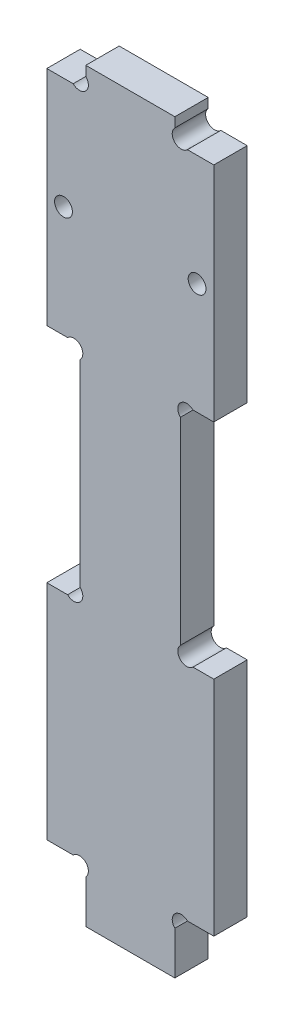
ISO-10303-21;
HEADER;
FILE_DESCRIPTION(('STEP AP214'),'2;1');
FILE_NAME('part.step','',(''),(''),'','','');
FILE_SCHEMA(('AUTOMOTIVE_DESIGN { 1 0 10303 214 1 1 1 1 }'));
ENDSEC;
DATA;
#1=APPLICATION_CONTEXT('core data for automotive mechanical design processes');
#2=APPLICATION_PROTOCOL_DEFINITION('international standard','automotive_design',2000,#1);
#3=PRODUCT_CONTEXT('',#1,'mechanical');
#4=PRODUCT('Part','Part','',(#3));
#5=PRODUCT_RELATED_PRODUCT_CATEGORY('part','',(#4));
#6=PRODUCT_DEFINITION_FORMATION('','',#4);
#7=PRODUCT_DEFINITION_CONTEXT('part definition',#1,'design');
#8=PRODUCT_DEFINITION('design','',#6,#7);
#9=PRODUCT_DEFINITION_SHAPE('','',#8);
#10=(LENGTH_UNIT() NAMED_UNIT(*) SI_UNIT(.MILLI.,.METRE.));
#11=(NAMED_UNIT(*) PLANE_ANGLE_UNIT() SI_UNIT($,.RADIAN.));
#12=(NAMED_UNIT(*) SI_UNIT($,.STERADIAN.) SOLID_ANGLE_UNIT());
#13=UNCERTAINTY_MEASURE_WITH_UNIT(LENGTH_MEASURE(1.E-05),#10,'distance_accuracy_value','');
#14=(GEOMETRIC_REPRESENTATION_CONTEXT(3) GLOBAL_UNCERTAINTY_ASSIGNED_CONTEXT((#13)) GLOBAL_UNIT_ASSIGNED_CONTEXT((#10,
#11,#12)) REPRESENTATION_CONTEXT('',''));
#15=CARTESIAN_POINT('',(0.,0.,0.));
#16=DIRECTION('',(0.,0.,1.));
#17=DIRECTION('',(1.,0.,0.));
#18=AXIS2_PLACEMENT_3D('',#15,#16,#17);
#19=CARTESIAN_POINT('',(24.1313708498985,8.86862915010153,6.));
#20=DIRECTION('',(0.,0.,1.));
#21=DIRECTION('',(1.,0.,0.));
#22=AXIS2_PLACEMENT_3D('',#19,#20,#21);
#23=PLANE('',#22);
#24=CARTESIAN_POINT('',(27.,110.,6.));
#25=DIRECTION('',(0.,0.,1.));
#26=DIRECTION('',(-1.,0.,0.));
#27=AXIS2_PLACEMENT_3D('',#24,#25,#26);
#28=CIRCLE('',#27,1.6);
#29=CARTESIAN_POINT('',(25.4,110.,6.));
#30=VERTEX_POINT('',#29);
#31=EDGE_CURVE('E241',#30,#30,#28,.T.);
#32=ORIENTED_EDGE('',*,*,#31,.F.);
#33=EDGE_LOOP('',(#32));
#34=FACE_BOUND('',#33,.T.);
#35=DIRECTION('',(0.,1.,0.));
#36=VECTOR('',#35,1.);
#37=CARTESIAN_POINT('',(30.,50.,6.));
#38=LINE('',#37,#36);
#39=CARTESIAN_POINT('',(30.,10.,6.));
#40=VERTEX_POINT('',#39);
#41=CARTESIAN_POINT('',(30.,50.,6.));
#42=VERTEX_POINT('',#41);
#43=EDGE_CURVE('E299',#40,#42,#38,.T.);
#44=ORIENTED_EDGE('',*,*,#43,.T.);
#45=DIRECTION('',(-1.,0.,0.));
#46=VECTOR('',#45,1.);
#47=CARTESIAN_POINT('',(26.262741699797,50.,6.));
#48=LINE('',#47,#46);
#49=CARTESIAN_POINT('',(26.262741699797,50.,6.));
#50=VERTEX_POINT('',#49);
#51=EDGE_CURVE('E236',#42,#50,#48,.T.);
#52=ORIENTED_EDGE('',*,*,#51,.T.);
#53=CARTESIAN_POINT('',(25.1313708498985,51.1313708498985,6.));
#54=DIRECTION('',(0.,0.,-1.));
#55=DIRECTION('',(1.,0.,0.));
#56=AXIS2_PLACEMENT_3D('',#53,#54,#55);
#57=CIRCLE('',#56,1.6);
#58=CARTESIAN_POINT('',(24.,52.2627416997969,6.));
#59=VERTEX_POINT('',#58);
#60=EDGE_CURVE('E302',#50,#59,#57,.T.);
#61=ORIENTED_EDGE('',*,*,#60,.T.);
#62=DIRECTION('',(0.,1.,0.));
#63=VECTOR('',#62,1.);
#64=CARTESIAN_POINT('',(24.,87.7372583002031,6.));
#65=LINE('',#64,#63);
#66=CARTESIAN_POINT('',(24.,87.7372583002031,6.));
#67=VERTEX_POINT('',#66);
#68=EDGE_CURVE('E304',#59,#67,#65,.T.);
#69=ORIENTED_EDGE('',*,*,#68,.T.);
#70=CARTESIAN_POINT('',(25.1313708498985,88.8686291501015,6.));
#71=DIRECTION('',(0.,0.,-1.));
#72=DIRECTION('',(-1.,0.,0.));
#73=AXIS2_PLACEMENT_3D('',#70,#71,#72);
#74=CIRCLE('',#73,1.6);
#75=CARTESIAN_POINT('',(26.262741699797,90.,6.));
#76=VERTEX_POINT('',#75);
#77=EDGE_CURVE('E306',#67,#76,#74,.T.);
#78=ORIENTED_EDGE('',*,*,#77,.T.);
#79=DIRECTION('',(1.,0.,0.));
#80=VECTOR('',#79,1.);
#81=CARTESIAN_POINT('',(26.262741699797,90.,6.));
#82=LINE('',#81,#80);
#83=CARTESIAN_POINT('',(30.,90.,6.));
#84=VERTEX_POINT('',#83);
#85=EDGE_CURVE('E308',#76,#84,#82,.T.);
#86=ORIENTED_EDGE('',*,*,#85,.T.);
#87=DIRECTION('',(0.,1.,0.));
#88=VECTOR('',#87,1.);
#89=CARTESIAN_POINT('',(30.,90.,6.));
#90=LINE('',#89,#88);
#91=CARTESIAN_POINT('',(30.,130.,6.));
#92=VERTEX_POINT('',#91);
#93=EDGE_CURVE('E310',#84,#92,#90,.T.);
#94=ORIENTED_EDGE('',*,*,#93,.T.);
#95=DIRECTION('',(-1.,0.,0.));
#96=VECTOR('',#95,1.);
#97=CARTESIAN_POINT('',(25.262741699797,130.,6.));
#98=LINE('',#97,#96);
#99=CARTESIAN_POINT('',(25.262741699797,130.,6.));
#100=VERTEX_POINT('',#99);
#101=EDGE_CURVE('E312',#92,#100,#98,.T.);
#102=ORIENTED_EDGE('',*,*,#101,.T.);
#103=CARTESIAN_POINT('',(24.1313708498985,131.131370849898,6.));
#104=DIRECTION('',(0.,0.,-1.));
#105=DIRECTION('',(-1.,0.,0.));
#106=AXIS2_PLACEMENT_3D('',#103,#104,#105);
#107=CIRCLE('',#106,1.60000000000001);
#108=CARTESIAN_POINT('',(23.,132.262741699797,6.));
#109=VERTEX_POINT('',#108);
#110=EDGE_CURVE('E314',#100,#109,#107,.T.);
#111=ORIENTED_EDGE('',*,*,#110,.T.);
#112=DIRECTION('',(0.,1.,0.));
#113=VECTOR('',#112,1.);
#114=CARTESIAN_POINT('',(23.,132.262741699797,6.));
#115=LINE('',#114,#113);
#116=CARTESIAN_POINT('',(23.,134.,6.));
#117=VERTEX_POINT('',#116);
#118=EDGE_CURVE('E316',#109,#117,#115,.T.);
#119=ORIENTED_EDGE('',*,*,#118,.T.);
#120=DIRECTION('',(-1.,0.,0.));
#121=VECTOR('',#120,1.);
#122=CARTESIAN_POINT('',(6.99999999999998,134.,6.));
#123=LINE('',#122,#121);
#124=CARTESIAN_POINT('',(6.99999999999998,134.,6.));
#125=VERTEX_POINT('',#124);
#126=EDGE_CURVE('E318',#117,#125,#123,.T.);
#127=ORIENTED_EDGE('',*,*,#126,.T.);
#128=DIRECTION('',(0.,-1.,0.));
#129=VECTOR('',#128,1.);
#130=CARTESIAN_POINT('',(6.99999999999998,132.262741699797,6.));
#131=LINE('',#130,#129);
#132=CARTESIAN_POINT('',(6.99999999999998,132.262741699797,6.));
#133=VERTEX_POINT('',#132);
#134=EDGE_CURVE('E320',#125,#133,#131,.T.);
#135=ORIENTED_EDGE('',*,*,#134,.T.);
#136=CARTESIAN_POINT('',(5.8686291501015,131.131370849898,6.));
#137=DIRECTION('',(0.,0.,-1.));
#138=DIRECTION('',(1.,0.,0.));
#139=AXIS2_PLACEMENT_3D('',#136,#137,#138);
#140=CIRCLE('',#139,1.60000000000001);
#141=CARTESIAN_POINT('',(4.73725830020302,130.,6.));
#142=VERTEX_POINT('',#141);
#143=EDGE_CURVE('E322',#133,#142,#140,.T.);
#144=ORIENTED_EDGE('',*,*,#143,.T.);
#145=DIRECTION('',(-1.,0.,0.));
#146=VECTOR('',#145,1.);
#147=CARTESIAN_POINT('',(4.73725830020302,130.,6.));
#148=LINE('',#147,#146);
#149=CARTESIAN_POINT('',(0.,130.,6.));
#150=VERTEX_POINT('',#149);
#151=EDGE_CURVE('E324',#142,#150,#148,.T.);
#152=ORIENTED_EDGE('',*,*,#151,.T.);
#153=DIRECTION('',(0.,-1.,0.));
#154=VECTOR('',#153,1.);
#155=CARTESIAN_POINT('',(0.,90.,6.));
#156=LINE('',#155,#154);
#157=CARTESIAN_POINT('',(0.,90.,6.));
#158=VERTEX_POINT('',#157);
#159=EDGE_CURVE('E326',#150,#158,#156,.T.);
#160=ORIENTED_EDGE('',*,*,#159,.T.);
#161=DIRECTION('',(1.,0.,0.));
#162=VECTOR('',#161,1.);
#163=CARTESIAN_POINT('',(3.73725830020305,90.,6.));
#164=LINE('',#163,#162);
#165=CARTESIAN_POINT('',(3.73725830020305,90.,6.));
#166=VERTEX_POINT('',#165);
#167=EDGE_CURVE('E328',#158,#166,#164,.T.);
#168=ORIENTED_EDGE('',*,*,#167,.T.);
#169=CARTESIAN_POINT('',(4.86862915010152,88.8686291501015,6.));
#170=DIRECTION('',(0.,0.,-1.));
#171=DIRECTION('',(1.,0.,0.));
#172=AXIS2_PLACEMENT_3D('',#169,#170,#171);
#173=CIRCLE('',#172,1.6);
#174=CARTESIAN_POINT('',(6.,87.7372583002031,6.));
#175=VERTEX_POINT('',#174);
#176=EDGE_CURVE('E330',#166,#175,#173,.T.);
#177=ORIENTED_EDGE('',*,*,#176,.T.);
#178=DIRECTION('',(0.,-1.,0.));
#179=VECTOR('',#178,1.);
#180=CARTESIAN_POINT('',(6.,87.7372583002031,6.));
#181=LINE('',#180,#179);
#182=CARTESIAN_POINT('',(6.,52.2627416997969,6.));
#183=VERTEX_POINT('',#182);
#184=EDGE_CURVE('E332',#175,#183,#181,.T.);
#185=ORIENTED_EDGE('',*,*,#184,.T.);
#186=CARTESIAN_POINT('',(4.86862915010152,51.1313708498985,6.));
#187=DIRECTION('',(0.,0.,-1.));
#188=DIRECTION('',(-1.,0.,0.));
#189=AXIS2_PLACEMENT_3D('',#186,#187,#188);
#190=CIRCLE('',#189,1.6);
#191=CARTESIAN_POINT('',(3.73725830020305,50.,6.));
#192=VERTEX_POINT('',#191);
#193=EDGE_CURVE('E334',#183,#192,#190,.T.);
#194=ORIENTED_EDGE('',*,*,#193,.T.);
#195=DIRECTION('',(-1.,0.,0.));
#196=VECTOR('',#195,1.);
#197=CARTESIAN_POINT('',(3.73725830020305,50.,6.));
#198=LINE('',#197,#196);
#199=CARTESIAN_POINT('',(0.,50.,6.));
#200=VERTEX_POINT('',#199);
#201=EDGE_CURVE('E336',#192,#200,#198,.T.);
#202=ORIENTED_EDGE('',*,*,#201,.T.);
#203=DIRECTION('',(0.,-1.,0.));
#204=VECTOR('',#203,1.);
#205=CARTESIAN_POINT('',(0.,50.,6.));
#206=LINE('',#205,#204);
#207=CARTESIAN_POINT('',(0.,10.,6.));
#208=VERTEX_POINT('',#207);
#209=EDGE_CURVE('E338',#200,#208,#206,.T.);
#210=ORIENTED_EDGE('',*,*,#209,.T.);
#211=DIRECTION('',(1.,0.,0.));
#212=VECTOR('',#211,1.);
#213=CARTESIAN_POINT('',(4.73725830020302,10.,6.));
#214=LINE('',#213,#212);
#215=CARTESIAN_POINT('',(4.73725830020302,10.,6.));
#216=VERTEX_POINT('',#215);
#217=EDGE_CURVE('E340',#208,#216,#214,.T.);
#218=ORIENTED_EDGE('',*,*,#217,.T.);
#219=CARTESIAN_POINT('',(5.8686291501015,8.86862915010153,6.));
#220=DIRECTION('',(0.,0.,-1.));
#221=DIRECTION('',(-1.,0.,0.));
#222=AXIS2_PLACEMENT_3D('',#219,#220,#221);
#223=CIRCLE('',#222,1.6);
#224=CARTESIAN_POINT('',(6.99999999999998,7.73725830020306,6.));
#225=VERTEX_POINT('',#224);
#226=EDGE_CURVE('E342',#216,#225,#223,.T.);
#227=ORIENTED_EDGE('',*,*,#226,.T.);
#228=DIRECTION('',(0.,-1.,0.));
#229=VECTOR('',#228,1.);
#230=CARTESIAN_POINT('',(6.99999999999998,7.73725830020306,6.));
#231=LINE('',#230,#229);
#232=CARTESIAN_POINT('',(6.99999999999998,0.,6.));
#233=VERTEX_POINT('',#232);
#234=EDGE_CURVE('E344',#225,#233,#231,.T.);
#235=ORIENTED_EDGE('',*,*,#234,.T.);
#236=DIRECTION('',(1.,0.,0.));
#237=VECTOR('',#236,1.);
#238=CARTESIAN_POINT('',(6.99999999999998,0.,6.));
#239=LINE('',#238,#237);
#240=CARTESIAN_POINT('',(23.,0.,6.));
#241=VERTEX_POINT('',#240);
#242=EDGE_CURVE('E346',#233,#241,#239,.T.);
#243=ORIENTED_EDGE('',*,*,#242,.T.);
#244=DIRECTION('',(0.,1.,0.));
#245=VECTOR('',#244,1.);
#246=CARTESIAN_POINT('',(23.,7.73725830020306,6.));
#247=LINE('',#246,#245);
#248=CARTESIAN_POINT('',(23.,7.73725830020306,6.));
#249=VERTEX_POINT('',#248);
#250=EDGE_CURVE('E348',#241,#249,#247,.T.);
#251=ORIENTED_EDGE('',*,*,#250,.T.);
#252=CARTESIAN_POINT('',(24.1313708498985,8.86862915010153,6.));
#253=DIRECTION('',(0.,0.,-1.));
#254=DIRECTION('',(1.,0.,0.));
#255=AXIS2_PLACEMENT_3D('',#252,#253,#254);
#256=CIRCLE('',#255,1.6);
#257=CARTESIAN_POINT('',(25.262741699797,10.,6.));
#258=VERTEX_POINT('',#257);
#259=EDGE_CURVE('E57',#249,#258,#256,.T.);
#260=ORIENTED_EDGE('',*,*,#259,.T.);
#261=DIRECTION('',(1.,0.,0.));
#262=VECTOR('',#261,1.);
#263=CARTESIAN_POINT('',(25.262741699797,10.,6.));
#264=LINE('',#263,#262);
#265=EDGE_CURVE('E52',#258,#40,#264,.T.);
#266=ORIENTED_EDGE('',*,*,#265,.T.);
#267=EDGE_LOOP('',(#44,#52,#61,#69,#78,#86,#94,#102,#111,#119,#127,#135,#144,#152,#160,#168,
#177,#185,#194,#202,#210,#218,#227,#235,#243,#251,#260,#266));
#268=FACE_BOUND('',#267,.T.);
#269=CARTESIAN_POINT('',(3.,110.,6.));
#270=DIRECTION('',(0.,0.,1.));
#271=DIRECTION('',(1.,0.,0.));
#272=AXIS2_PLACEMENT_3D('',#269,#270,#271);
#273=CIRCLE('',#272,1.6);
#274=CARTESIAN_POINT('',(4.6,110.,6.));
#275=VERTEX_POINT('',#274);
#276=EDGE_CURVE('E579',#275,#275,#273,.T.);
#277=ORIENTED_EDGE('',*,*,#276,.F.);
#278=EDGE_LOOP('',(#277));
#279=FACE_BOUND('',#278,.T.);
#280=ADVANCED_FACE('F37',(#34,#268,#279),#23,.T.);
#281=CARTESIAN_POINT('',(24.1313708498985,8.86862915010153,0.));
#282=DIRECTION('',(0.,0.,1.));
#283=DIRECTION('',(1.,0.,0.));
#284=AXIS2_PLACEMENT_3D('',#281,#282,#283);
#285=PLANE('',#284);
#286=CARTESIAN_POINT('',(27.,110.,0.));
#287=DIRECTION('',(0.,0.,1.));
#288=DIRECTION('',(-1.,0.,0.));
#289=AXIS2_PLACEMENT_3D('',#286,#287,#288);
#290=CIRCLE('',#289,1.6);
#291=CARTESIAN_POINT('',(25.4,110.,0.));
#292=VERTEX_POINT('',#291);
#293=EDGE_CURVE('E244',#292,#292,#290,.T.);
#294=ORIENTED_EDGE('',*,*,#293,.T.);
#295=EDGE_LOOP('',(#294));
#296=FACE_BOUND('',#295,.T.);
#297=DIRECTION('',(0.,1.,0.));
#298=VECTOR('',#297,1.);
#299=CARTESIAN_POINT('',(30.,50.,0.));
#300=LINE('',#299,#298);
#301=CARTESIAN_POINT('',(30.,10.,0.));
#302=VERTEX_POINT('',#301);
#303=CARTESIAN_POINT('',(30.,50.,0.));
#304=VERTEX_POINT('',#303);
#305=EDGE_CURVE('E227',#302,#304,#300,.T.);
#306=ORIENTED_EDGE('',*,*,#305,.F.);
#307=DIRECTION('',(1.,0.,0.));
#308=VECTOR('',#307,1.);
#309=CARTESIAN_POINT('',(25.262741699797,10.,0.));
#310=LINE('',#309,#308);
#311=CARTESIAN_POINT('',(25.262741699797,10.,0.));
#312=VERTEX_POINT('',#311);
#313=EDGE_CURVE('E297',#312,#302,#310,.T.);
#314=ORIENTED_EDGE('',*,*,#313,.F.);
#315=CARTESIAN_POINT('',(24.1313708498985,8.86862915010153,0.));
#316=DIRECTION('',(0.,0.,-1.));
#317=DIRECTION('',(1.,0.,0.));
#318=AXIS2_PLACEMENT_3D('',#315,#316,#317);
#319=CIRCLE('',#318,1.6);
#320=CARTESIAN_POINT('',(23.,7.73725830020306,0.));
#321=VERTEX_POINT('',#320);
#322=EDGE_CURVE('E295',#321,#312,#319,.T.);
#323=ORIENTED_EDGE('',*,*,#322,.F.);
#324=DIRECTION('',(0.,1.,0.));
#325=VECTOR('',#324,1.);
#326=CARTESIAN_POINT('',(23.,7.73725830020306,0.));
#327=LINE('',#326,#325);
#328=CARTESIAN_POINT('',(23.,0.,0.));
#329=VERTEX_POINT('',#328);
#330=EDGE_CURVE('E293',#329,#321,#327,.T.);
#331=ORIENTED_EDGE('',*,*,#330,.F.);
#332=DIRECTION('',(1.,0.,0.));
#333=VECTOR('',#332,1.);
#334=CARTESIAN_POINT('',(6.99999999999998,0.,0.));
#335=LINE('',#334,#333);
#336=CARTESIAN_POINT('',(6.99999999999998,0.,0.));
#337=VERTEX_POINT('',#336);
#338=EDGE_CURVE('E291',#337,#329,#335,.T.);
#339=ORIENTED_EDGE('',*,*,#338,.F.);
#340=DIRECTION('',(0.,-1.,0.));
#341=VECTOR('',#340,1.);
#342=CARTESIAN_POINT('',(6.99999999999998,7.73725830020306,0.));
#343=LINE('',#342,#341);
#344=CARTESIAN_POINT('',(6.99999999999998,7.73725830020306,0.));
#345=VERTEX_POINT('',#344);
#346=EDGE_CURVE('E289',#345,#337,#343,.T.);
#347=ORIENTED_EDGE('',*,*,#346,.F.);
#348=CARTESIAN_POINT('',(5.8686291501015,8.86862915010153,0.));
#349=DIRECTION('',(0.,0.,-1.));
#350=DIRECTION('',(-1.,0.,0.));
#351=AXIS2_PLACEMENT_3D('',#348,#349,#350);
#352=CIRCLE('',#351,1.6);
#353=CARTESIAN_POINT('',(4.73725830020302,10.,0.));
#354=VERTEX_POINT('',#353);
#355=EDGE_CURVE('E287',#354,#345,#352,.T.);
#356=ORIENTED_EDGE('',*,*,#355,.F.);
#357=DIRECTION('',(1.,0.,0.));
#358=VECTOR('',#357,1.);
#359=CARTESIAN_POINT('',(4.73725830020302,10.,0.));
#360=LINE('',#359,#358);
#361=CARTESIAN_POINT('',(0.,10.,0.));
#362=VERTEX_POINT('',#361);
#363=EDGE_CURVE('E285',#362,#354,#360,.T.);
#364=ORIENTED_EDGE('',*,*,#363,.F.);
#365=DIRECTION('',(0.,-1.,0.));
#366=VECTOR('',#365,1.);
#367=CARTESIAN_POINT('',(0.,50.,0.));
#368=LINE('',#367,#366);
#369=CARTESIAN_POINT('',(0.,50.,0.));
#370=VERTEX_POINT('',#369);
#371=EDGE_CURVE('E283',#370,#362,#368,.T.);
#372=ORIENTED_EDGE('',*,*,#371,.F.);
#373=DIRECTION('',(-1.,0.,0.));
#374=VECTOR('',#373,1.);
#375=CARTESIAN_POINT('',(3.73725830020305,50.,0.));
#376=LINE('',#375,#374);
#377=CARTESIAN_POINT('',(3.73725830020305,50.,0.));
#378=VERTEX_POINT('',#377);
#379=EDGE_CURVE('E281',#378,#370,#376,.T.);
#380=ORIENTED_EDGE('',*,*,#379,.F.);
#381=CARTESIAN_POINT('',(4.86862915010152,51.1313708498985,0.));
#382=DIRECTION('',(0.,0.,-1.));
#383=DIRECTION('',(-1.,0.,0.));
#384=AXIS2_PLACEMENT_3D('',#381,#382,#383);
#385=CIRCLE('',#384,1.6);
#386=CARTESIAN_POINT('',(6.,52.2627416997969,0.));
#387=VERTEX_POINT('',#386);
#388=EDGE_CURVE('E279',#387,#378,#385,.T.);
#389=ORIENTED_EDGE('',*,*,#388,.F.);
#390=DIRECTION('',(0.,-1.,0.));
#391=VECTOR('',#390,1.);
#392=CARTESIAN_POINT('',(6.,87.7372583002031,0.));
#393=LINE('',#392,#391);
#394=CARTESIAN_POINT('',(6.,87.7372583002031,0.));
#395=VERTEX_POINT('',#394);
#396=EDGE_CURVE('E277',#395,#387,#393,.T.);
#397=ORIENTED_EDGE('',*,*,#396,.F.);
#398=CARTESIAN_POINT('',(4.86862915010152,88.8686291501015,0.));
#399=DIRECTION('',(0.,0.,-1.));
#400=DIRECTION('',(1.,0.,0.));
#401=AXIS2_PLACEMENT_3D('',#398,#399,#400);
#402=CIRCLE('',#401,1.6);
#403=CARTESIAN_POINT('',(3.73725830020305,90.,0.));
#404=VERTEX_POINT('',#403);
#405=EDGE_CURVE('E275',#404,#395,#402,.T.);
#406=ORIENTED_EDGE('',*,*,#405,.F.);
#407=DIRECTION('',(1.,0.,0.));
#408=VECTOR('',#407,1.);
#409=CARTESIAN_POINT('',(3.73725830020305,90.,0.));
#410=LINE('',#409,#408);
#411=CARTESIAN_POINT('',(0.,90.,0.));
#412=VERTEX_POINT('',#411);
#413=EDGE_CURVE('E273',#412,#404,#410,.T.);
#414=ORIENTED_EDGE('',*,*,#413,.F.);
#415=DIRECTION('',(0.,-1.,0.));
#416=VECTOR('',#415,1.);
#417=CARTESIAN_POINT('',(0.,90.,0.));
#418=LINE('',#417,#416);
#419=CARTESIAN_POINT('',(0.,130.,0.));
#420=VERTEX_POINT('',#419);
#421=EDGE_CURVE('E271',#420,#412,#418,.T.);
#422=ORIENTED_EDGE('',*,*,#421,.F.);
#423=DIRECTION('',(-1.,0.,0.));
#424=VECTOR('',#423,1.);
#425=CARTESIAN_POINT('',(4.73725830020302,130.,0.));
#426=LINE('',#425,#424);
#427=CARTESIAN_POINT('',(4.73725830020302,130.,0.));
#428=VERTEX_POINT('',#427);
#429=EDGE_CURVE('E269',#428,#420,#426,.T.);
#430=ORIENTED_EDGE('',*,*,#429,.F.);
#431=CARTESIAN_POINT('',(5.8686291501015,131.131370849898,0.));
#432=DIRECTION('',(0.,0.,-1.));
#433=DIRECTION('',(1.,0.,0.));
#434=AXIS2_PLACEMENT_3D('',#431,#432,#433);
#435=CIRCLE('',#434,1.60000000000001);
#436=CARTESIAN_POINT('',(6.99999999999998,132.262741699797,0.));
#437=VERTEX_POINT('',#436);
#438=EDGE_CURVE('E267',#437,#428,#435,.T.);
#439=ORIENTED_EDGE('',*,*,#438,.F.);
#440=DIRECTION('',(0.,-1.,0.));
#441=VECTOR('',#440,1.);
#442=CARTESIAN_POINT('',(6.99999999999998,132.262741699797,0.));
#443=LINE('',#442,#441);
#444=CARTESIAN_POINT('',(6.99999999999998,134.,0.));
#445=VERTEX_POINT('',#444);
#446=EDGE_CURVE('E265',#445,#437,#443,.T.);
#447=ORIENTED_EDGE('',*,*,#446,.F.);
#448=DIRECTION('',(-1.,0.,0.));
#449=VECTOR('',#448,1.);
#450=CARTESIAN_POINT('',(6.99999999999998,134.,0.));
#451=LINE('',#450,#449);
#452=CARTESIAN_POINT('',(23.,134.,0.));
#453=VERTEX_POINT('',#452);
#454=EDGE_CURVE('E263',#453,#445,#451,.T.);
#455=ORIENTED_EDGE('',*,*,#454,.F.);
#456=DIRECTION('',(0.,1.,0.));
#457=VECTOR('',#456,1.);
#458=CARTESIAN_POINT('',(23.,132.262741699797,0.));
#459=LINE('',#458,#457);
#460=CARTESIAN_POINT('',(23.,132.262741699797,0.));
#461=VERTEX_POINT('',#460);
#462=EDGE_CURVE('E261',#461,#453,#459,.T.);
#463=ORIENTED_EDGE('',*,*,#462,.F.);
#464=CARTESIAN_POINT('',(24.1313708498985,131.131370849898,0.));
#465=DIRECTION('',(0.,0.,-1.));
#466=DIRECTION('',(-1.,0.,0.));
#467=AXIS2_PLACEMENT_3D('',#464,#465,#466);
#468=CIRCLE('',#467,1.60000000000001);
#469=CARTESIAN_POINT('',(25.262741699797,130.,0.));
#470=VERTEX_POINT('',#469);
#471=EDGE_CURVE('E259',#470,#461,#468,.T.);
#472=ORIENTED_EDGE('',*,*,#471,.F.);
#473=DIRECTION('',(-1.,0.,0.));
#474=VECTOR('',#473,1.);
#475=CARTESIAN_POINT('',(25.262741699797,130.,0.));
#476=LINE('',#475,#474);
#477=CARTESIAN_POINT('',(30.,130.,0.));
#478=VERTEX_POINT('',#477);
#479=EDGE_CURVE('E257',#478,#470,#476,.T.);
#480=ORIENTED_EDGE('',*,*,#479,.F.);
#481=DIRECTION('',(0.,1.,0.));
#482=VECTOR('',#481,1.);
#483=CARTESIAN_POINT('',(30.,90.,0.));
#484=LINE('',#483,#482);
#485=CARTESIAN_POINT('',(30.,90.,0.));
#486=VERTEX_POINT('',#485);
#487=EDGE_CURVE('E255',#486,#478,#484,.T.);
#488=ORIENTED_EDGE('',*,*,#487,.F.);
#489=DIRECTION('',(1.,0.,0.));
#490=VECTOR('',#489,1.);
#491=CARTESIAN_POINT('',(26.262741699797,90.,0.));
#492=LINE('',#491,#490);
#493=CARTESIAN_POINT('',(26.262741699797,90.,0.));
#494=VERTEX_POINT('',#493);
#495=EDGE_CURVE('E253',#494,#486,#492,.T.);
#496=ORIENTED_EDGE('',*,*,#495,.F.);
#497=CARTESIAN_POINT('',(25.1313708498985,88.8686291501015,0.));
#498=DIRECTION('',(0.,0.,-1.));
#499=DIRECTION('',(-1.,0.,0.));
#500=AXIS2_PLACEMENT_3D('',#497,#498,#499);
#501=CIRCLE('',#500,1.6);
#502=CARTESIAN_POINT('',(24.,87.7372583002031,0.));
#503=VERTEX_POINT('',#502);
#504=EDGE_CURVE('E251',#503,#494,#501,.T.);
#505=ORIENTED_EDGE('',*,*,#504,.F.);
#506=DIRECTION('',(0.,1.,0.));
#507=VECTOR('',#506,1.);
#508=CARTESIAN_POINT('',(24.,87.7372583002031,0.));
#509=LINE('',#508,#507);
#510=CARTESIAN_POINT('',(24.,52.2627416997969,0.));
#511=VERTEX_POINT('',#510);
#512=EDGE_CURVE('E249',#511,#503,#509,.T.);
#513=ORIENTED_EDGE('',*,*,#512,.F.);
#514=CARTESIAN_POINT('',(25.1313708498985,51.1313708498985,0.));
#515=DIRECTION('',(0.,0.,-1.));
#516=DIRECTION('',(1.,0.,0.));
#517=AXIS2_PLACEMENT_3D('',#514,#515,#516);
#518=CIRCLE('',#517,1.6);
#519=CARTESIAN_POINT('',(26.262741699797,50.,0.));
#520=VERTEX_POINT('',#519);
#521=EDGE_CURVE('E229',#520,#511,#518,.T.);
#522=ORIENTED_EDGE('',*,*,#521,.F.);
#523=DIRECTION('',(-1.,0.,0.));
#524=VECTOR('',#523,1.);
#525=CARTESIAN_POINT('',(26.262741699797,50.,0.));
#526=LINE('',#525,#524);
#527=EDGE_CURVE('E222',#304,#520,#526,.T.);
#528=ORIENTED_EDGE('',*,*,#527,.F.);
#529=EDGE_LOOP('',(#306,#314,#323,#331,#339,#347,#356,#364,#372,#380,#389,#397,#406,#414,#422,
#430,#439,#447,#455,#463,#472,#480,#488,#496,#505,#513,#522,#528));
#530=FACE_BOUND('',#529,.T.);
#531=CARTESIAN_POINT('',(3.,110.,0.));
#532=DIRECTION('',(0.,0.,1.));
#533=DIRECTION('',(1.,0.,0.));
#534=AXIS2_PLACEMENT_3D('',#531,#532,#533);
#535=CIRCLE('',#534,1.6);
#536=CARTESIAN_POINT('',(4.6,110.,0.));
#537=VERTEX_POINT('',#536);
#538=EDGE_CURVE('E582',#537,#537,#535,.T.);
#539=ORIENTED_EDGE('',*,*,#538,.T.);
#540=EDGE_LOOP('',(#539));
#541=FACE_BOUND('',#540,.T.);
#542=ADVANCED_FACE('F223',(#296,#530,#541),#285,.F.);
#543=CARTESIAN_POINT('',(30.,50.,6.));
#544=DIRECTION('',(-1.,0.,0.));
#545=DIRECTION('',(0.,0.,1.));
#546=AXIS2_PLACEMENT_3D('',#543,#544,#545);
#547=PLANE('',#546);
#548=ORIENTED_EDGE('',*,*,#305,.T.);
#549=DIRECTION('',(0.,0.,-1.));
#550=VECTOR('',#549,1.);
#551=CARTESIAN_POINT('',(30.,50.,6.));
#552=LINE('',#551,#550);
#553=EDGE_CURVE('E11',#42,#304,#552,.T.);
#554=ORIENTED_EDGE('',*,*,#553,.F.);
#555=ORIENTED_EDGE('',*,*,#43,.F.);
#556=DIRECTION('',(0.,0.,-1.));
#557=VECTOR('',#556,1.);
#558=CARTESIAN_POINT('',(30.,10.,6.));
#559=LINE('',#558,#557);
#560=EDGE_CURVE('E240',#40,#302,#559,.T.);
#561=ORIENTED_EDGE('',*,*,#560,.T.);
#562=EDGE_LOOP('',(#548,#554,#555,#561));
#563=FACE_BOUND('',#562,.T.);
#564=ADVANCED_FACE('F39',(#563),#547,.F.);
#565=CARTESIAN_POINT('',(26.262741699797,50.,6.));
#566=DIRECTION('',(0.,-1.,0.));
#567=DIRECTION('',(1.,0.,0.));
#568=AXIS2_PLACEMENT_3D('',#565,#566,#567);
#569=PLANE('',#568);
#570=ORIENTED_EDGE('',*,*,#527,.T.);
#571=DIRECTION('',(0.,0.,-1.));
#572=VECTOR('',#571,1.);
#573=CARTESIAN_POINT('',(26.262741699797,50.,6.));
#574=LINE('',#573,#572);
#575=EDGE_CURVE('E45',#50,#520,#574,.T.);
#576=ORIENTED_EDGE('',*,*,#575,.F.);
#577=ORIENTED_EDGE('',*,*,#51,.F.);
#578=ORIENTED_EDGE('',*,*,#553,.T.);
#579=EDGE_LOOP('',(#570,#576,#577,#578));
#580=FACE_BOUND('',#579,.T.);
#581=ADVANCED_FACE('F235',(#580),#569,.F.);
#582=CARTESIAN_POINT('',(25.1313708498985,51.1313708498985,6.));
#583=DIRECTION('',(0.,0.,-1.));
#584=DIRECTION('',(-1.,0.,0.));
#585=AXIS2_PLACEMENT_3D('',#582,#583,#584);
#586=CYLINDRICAL_SURFACE('',#585,1.6);
#587=ORIENTED_EDGE('',*,*,#521,.T.);
#588=DIRECTION('',(0.,0.,-1.));
#589=VECTOR('',#588,1.);
#590=CARTESIAN_POINT('',(24.,52.2627416997969,6.));
#591=LINE('',#590,#589);
#592=EDGE_CURVE('E425',#59,#511,#591,.T.);
#593=ORIENTED_EDGE('',*,*,#592,.F.);
#594=ORIENTED_EDGE('',*,*,#60,.F.);
#595=ORIENTED_EDGE('',*,*,#575,.T.);
#596=EDGE_LOOP('',(#587,#593,#594,#595));
#597=FACE_BOUND('',#596,.T.);
#598=ADVANCED_FACE('F429',(#597),#586,.F.);
#599=CARTESIAN_POINT('',(24.,87.7372583002031,6.));
#600=DIRECTION('',(-1.,0.,0.));
#601=DIRECTION('',(0.,0.,1.));
#602=AXIS2_PLACEMENT_3D('',#599,#600,#601);
#603=PLANE('',#602);
#604=ORIENTED_EDGE('',*,*,#512,.T.);
#605=DIRECTION('',(0.,0.,-1.));
#606=VECTOR('',#605,1.);
#607=CARTESIAN_POINT('',(24.,87.7372583002031,6.));
#608=LINE('',#607,#606);
#609=EDGE_CURVE('E422',#67,#503,#608,.T.);
#610=ORIENTED_EDGE('',*,*,#609,.F.);
#611=ORIENTED_EDGE('',*,*,#68,.F.);
#612=ORIENTED_EDGE('',*,*,#592,.T.);
#613=EDGE_LOOP('',(#604,#610,#611,#612));
#614=FACE_BOUND('',#613,.T.);
#615=ADVANCED_FACE('F437',(#614),#603,.F.);
#616=CARTESIAN_POINT('',(25.1313708498985,88.8686291501015,6.));
#617=DIRECTION('',(0.,0.,-1.));
#618=DIRECTION('',(-1.,0.,0.));
#619=AXIS2_PLACEMENT_3D('',#616,#617,#618);
#620=CYLINDRICAL_SURFACE('',#619,1.6);
#621=ORIENTED_EDGE('',*,*,#504,.T.);
#622=DIRECTION('',(0.,0.,-1.));
#623=VECTOR('',#622,1.);
#624=CARTESIAN_POINT('',(26.262741699797,90.,6.));
#625=LINE('',#624,#623);
#626=EDGE_CURVE('E419',#76,#494,#625,.T.);
#627=ORIENTED_EDGE('',*,*,#626,.F.);
#628=ORIENTED_EDGE('',*,*,#77,.F.);
#629=ORIENTED_EDGE('',*,*,#609,.T.);
#630=EDGE_LOOP('',(#621,#627,#628,#629));
#631=FACE_BOUND('',#630,.T.);
#632=ADVANCED_FACE('F440',(#631),#620,.F.);
#633=CARTESIAN_POINT('',(26.262741699797,90.,6.));
#634=DIRECTION('',(0.,1.,0.));
#635=DIRECTION('',(-1.,0.,0.));
#636=AXIS2_PLACEMENT_3D('',#633,#634,#635);
#637=PLANE('',#636);
#638=ORIENTED_EDGE('',*,*,#495,.T.);
#639=DIRECTION('',(0.,0.,-1.));
#640=VECTOR('',#639,1.);
#641=CARTESIAN_POINT('',(30.,90.,6.));
#642=LINE('',#641,#640);
#643=EDGE_CURVE('E416',#84,#486,#642,.T.);
#644=ORIENTED_EDGE('',*,*,#643,.F.);
#645=ORIENTED_EDGE('',*,*,#85,.F.);
#646=ORIENTED_EDGE('',*,*,#626,.T.);
#647=EDGE_LOOP('',(#638,#644,#645,#646));
#648=FACE_BOUND('',#647,.T.);
#649=ADVANCED_FACE('F445',(#648),#637,.F.);
#650=CARTESIAN_POINT('',(30.,90.,6.));
#651=DIRECTION('',(-1.,0.,0.));
#652=DIRECTION('',(0.,0.,1.));
#653=AXIS2_PLACEMENT_3D('',#650,#651,#652);
#654=PLANE('',#653);
#655=ORIENTED_EDGE('',*,*,#487,.T.);
#656=DIRECTION('',(0.,0.,-1.));
#657=VECTOR('',#656,1.);
#658=CARTESIAN_POINT('',(30.,130.,6.));
#659=LINE('',#658,#657);
#660=EDGE_CURVE('E413',#92,#478,#659,.T.);
#661=ORIENTED_EDGE('',*,*,#660,.F.);
#662=ORIENTED_EDGE('',*,*,#93,.F.);
#663=ORIENTED_EDGE('',*,*,#643,.T.);
#664=EDGE_LOOP('',(#655,#661,#662,#663));
#665=FACE_BOUND('',#664,.T.);
#666=ADVANCED_FACE('F451',(#665),#654,.F.);
#667=CARTESIAN_POINT('',(25.262741699797,130.,6.));
#668=DIRECTION('',(0.,-1.,0.));
#669=DIRECTION('',(0.,0.,-1.));
#670=AXIS2_PLACEMENT_3D('',#667,#668,#669);
#671=PLANE('',#670);
#672=ORIENTED_EDGE('',*,*,#479,.T.);
#673=DIRECTION('',(0.,0.,-1.));
#674=VECTOR('',#673,1.);
#675=CARTESIAN_POINT('',(25.262741699797,130.,6.));
#676=LINE('',#675,#674);
#677=EDGE_CURVE('E410',#100,#470,#676,.T.);
#678=ORIENTED_EDGE('',*,*,#677,.F.);
#679=ORIENTED_EDGE('',*,*,#101,.F.);
#680=ORIENTED_EDGE('',*,*,#660,.T.);
#681=EDGE_LOOP('',(#672,#678,#679,#680));
#682=FACE_BOUND('',#681,.T.);
#683=ADVANCED_FACE('F455',(#682),#671,.F.);
#684=CARTESIAN_POINT('',(24.1313708498985,131.131370849898,6.));
#685=DIRECTION('',(0.,0.,-1.));
#686=DIRECTION('',(-1.,0.,0.));
#687=AXIS2_PLACEMENT_3D('',#684,#685,#686);
#688=CYLINDRICAL_SURFACE('',#687,1.60000000000001);
#689=ORIENTED_EDGE('',*,*,#471,.T.);
#690=DIRECTION('',(0.,0.,-1.));
#691=VECTOR('',#690,1.);
#692=CARTESIAN_POINT('',(23.,132.262741699797,6.));
#693=LINE('',#692,#691);
#694=EDGE_CURVE('E407',#109,#461,#693,.T.);
#695=ORIENTED_EDGE('',*,*,#694,.F.);
#696=ORIENTED_EDGE('',*,*,#110,.F.);
#697=ORIENTED_EDGE('',*,*,#677,.T.);
#698=EDGE_LOOP('',(#689,#695,#696,#697));
#699=FACE_BOUND('',#698,.T.);
#700=ADVANCED_FACE('F460',(#699),#688,.F.);
#701=CARTESIAN_POINT('',(23.,132.262741699797,6.));
#702=DIRECTION('',(-1.,0.,0.));
#703=DIRECTION('',(0.,0.,1.));
#704=AXIS2_PLACEMENT_3D('',#701,#702,#703);
#705=PLANE('',#704);
#706=ORIENTED_EDGE('',*,*,#462,.T.);
#707=DIRECTION('',(0.,0.,-1.));
#708=VECTOR('',#707,1.);
#709=CARTESIAN_POINT('',(23.,134.,6.));
#710=LINE('',#709,#708);
#711=EDGE_CURVE('E404',#117,#453,#710,.T.);
#712=ORIENTED_EDGE('',*,*,#711,.F.);
#713=ORIENTED_EDGE('',*,*,#118,.F.);
#714=ORIENTED_EDGE('',*,*,#694,.T.);
#715=EDGE_LOOP('',(#706,#712,#713,#714));
#716=FACE_BOUND('',#715,.T.);
#717=ADVANCED_FACE('F466',(#716),#705,.F.);
#718=CARTESIAN_POINT('',(6.99999999999998,134.,6.));
#719=DIRECTION('',(0.,-1.,0.));
#720=DIRECTION('',(0.,0.,-1.));
#721=AXIS2_PLACEMENT_3D('',#718,#719,#720);
#722=PLANE('',#721);
#723=ORIENTED_EDGE('',*,*,#454,.T.);
#724=DIRECTION('',(0.,0.,-1.));
#725=VECTOR('',#724,1.);
#726=CARTESIAN_POINT('',(6.99999999999998,134.,6.));
#727=LINE('',#726,#725);
#728=EDGE_CURVE('E401',#125,#445,#727,.T.);
#729=ORIENTED_EDGE('',*,*,#728,.F.);
#730=ORIENTED_EDGE('',*,*,#126,.F.);
#731=ORIENTED_EDGE('',*,*,#711,.T.);
#732=EDGE_LOOP('',(#723,#729,#730,#731));
#733=FACE_BOUND('',#732,.T.);
#734=ADVANCED_FACE('F470',(#733),#722,.F.);
#735=CARTESIAN_POINT('',(6.99999999999998,132.262741699797,6.));
#736=DIRECTION('',(1.,0.,0.));
#737=DIRECTION('',(0.,0.,-1.));
#738=AXIS2_PLACEMENT_3D('',#735,#736,#737);
#739=PLANE('',#738);
#740=ORIENTED_EDGE('',*,*,#446,.T.);
#741=DIRECTION('',(0.,0.,-1.));
#742=VECTOR('',#741,1.);
#743=CARTESIAN_POINT('',(6.99999999999998,132.262741699797,6.));
#744=LINE('',#743,#742);
#745=EDGE_CURVE('E398',#133,#437,#744,.T.);
#746=ORIENTED_EDGE('',*,*,#745,.F.);
#747=ORIENTED_EDGE('',*,*,#134,.F.);
#748=ORIENTED_EDGE('',*,*,#728,.T.);
#749=EDGE_LOOP('',(#740,#746,#747,#748));
#750=FACE_BOUND('',#749,.T.);
#751=ADVANCED_FACE('F475',(#750),#739,.F.);
#752=CARTESIAN_POINT('',(5.8686291501015,131.131370849898,6.));
#753=DIRECTION('',(0.,0.,-1.));
#754=DIRECTION('',(-1.,0.,0.));
#755=AXIS2_PLACEMENT_3D('',#752,#753,#754);
#756=CYLINDRICAL_SURFACE('',#755,1.60000000000001);
#757=ORIENTED_EDGE('',*,*,#438,.T.);
#758=DIRECTION('',(0.,0.,-1.));
#759=VECTOR('',#758,1.);
#760=CARTESIAN_POINT('',(4.73725830020302,130.,6.));
#761=LINE('',#760,#759);
#762=EDGE_CURVE('E395',#142,#428,#761,.T.);
#763=ORIENTED_EDGE('',*,*,#762,.F.);
#764=ORIENTED_EDGE('',*,*,#143,.F.);
#765=ORIENTED_EDGE('',*,*,#745,.T.);
#766=EDGE_LOOP('',(#757,#763,#764,#765));
#767=FACE_BOUND('',#766,.T.);
#768=ADVANCED_FACE('F481',(#767),#756,.F.);
#769=CARTESIAN_POINT('',(4.73725830020302,130.,6.));
#770=DIRECTION('',(0.,-1.,0.));
#771=DIRECTION('',(0.,0.,-1.));
#772=AXIS2_PLACEMENT_3D('',#769,#770,#771);
#773=PLANE('',#772);
#774=ORIENTED_EDGE('',*,*,#429,.T.);
#775=DIRECTION('',(0.,0.,-1.));
#776=VECTOR('',#775,1.);
#777=CARTESIAN_POINT('',(0.,130.,6.));
#778=LINE('',#777,#776);
#779=EDGE_CURVE('E392',#150,#420,#778,.T.);
#780=ORIENTED_EDGE('',*,*,#779,.F.);
#781=ORIENTED_EDGE('',*,*,#151,.F.);
#782=ORIENTED_EDGE('',*,*,#762,.T.);
#783=EDGE_LOOP('',(#774,#780,#781,#782));
#784=FACE_BOUND('',#783,.T.);
#785=ADVANCED_FACE('F485',(#784),#773,.F.);
#786=CARTESIAN_POINT('',(0.,90.,6.));
#787=DIRECTION('',(1.,0.,0.));
#788=DIRECTION('',(0.,0.,-1.));
#789=AXIS2_PLACEMENT_3D('',#786,#787,#788);
#790=PLANE('',#789);
#791=ORIENTED_EDGE('',*,*,#421,.T.);
#792=DIRECTION('',(0.,0.,-1.));
#793=VECTOR('',#792,1.);
#794=CARTESIAN_POINT('',(0.,90.,6.));
#795=LINE('',#794,#793);
#796=EDGE_CURVE('E389',#158,#412,#795,.T.);
#797=ORIENTED_EDGE('',*,*,#796,.F.);
#798=ORIENTED_EDGE('',*,*,#159,.F.);
#799=ORIENTED_EDGE('',*,*,#779,.T.);
#800=EDGE_LOOP('',(#791,#797,#798,#799));
#801=FACE_BOUND('',#800,.T.);
#802=ADVANCED_FACE('F490',(#801),#790,.F.);
#803=CARTESIAN_POINT('',(3.73725830020305,90.,6.));
#804=DIRECTION('',(0.,1.,0.));
#805=DIRECTION('',(-1.,0.,0.));
#806=AXIS2_PLACEMENT_3D('',#803,#804,#805);
#807=PLANE('',#806);
#808=ORIENTED_EDGE('',*,*,#413,.T.);
#809=DIRECTION('',(0.,0.,-1.));
#810=VECTOR('',#809,1.);
#811=CARTESIAN_POINT('',(3.73725830020305,90.,6.));
#812=LINE('',#811,#810);
#813=EDGE_CURVE('E386',#166,#404,#812,.T.);
#814=ORIENTED_EDGE('',*,*,#813,.F.);
#815=ORIENTED_EDGE('',*,*,#167,.F.);
#816=ORIENTED_EDGE('',*,*,#796,.T.);
#817=EDGE_LOOP('',(#808,#814,#815,#816));
#818=FACE_BOUND('',#817,.T.);
#819=ADVANCED_FACE('F496',(#818),#807,.F.);
#820=CARTESIAN_POINT('',(4.86862915010152,88.8686291501015,6.));
#821=DIRECTION('',(0.,0.,-1.));
#822=DIRECTION('',(-1.,0.,0.));
#823=AXIS2_PLACEMENT_3D('',#820,#821,#822);
#824=CYLINDRICAL_SURFACE('',#823,1.6);
#825=ORIENTED_EDGE('',*,*,#405,.T.);
#826=DIRECTION('',(0.,0.,-1.));
#827=VECTOR('',#826,1.);
#828=CARTESIAN_POINT('',(6.,87.7372583002031,6.));
#829=LINE('',#828,#827);
#830=EDGE_CURVE('E383',#175,#395,#829,.T.);
#831=ORIENTED_EDGE('',*,*,#830,.F.);
#832=ORIENTED_EDGE('',*,*,#176,.F.);
#833=ORIENTED_EDGE('',*,*,#813,.T.);
#834=EDGE_LOOP('',(#825,#831,#832,#833));
#835=FACE_BOUND('',#834,.T.);
#836=ADVANCED_FACE('F500',(#835),#824,.F.);
#837=CARTESIAN_POINT('',(6.,87.7372583002031,6.));
#838=DIRECTION('',(1.,0.,0.));
#839=DIRECTION('',(0.,0.,-1.));
#840=AXIS2_PLACEMENT_3D('',#837,#838,#839);
#841=PLANE('',#840);
#842=ORIENTED_EDGE('',*,*,#396,.T.);
#843=DIRECTION('',(0.,0.,-1.));
#844=VECTOR('',#843,1.);
#845=CARTESIAN_POINT('',(6.,52.2627416997969,6.));
#846=LINE('',#845,#844);
#847=EDGE_CURVE('E380',#183,#387,#846,.T.);
#848=ORIENTED_EDGE('',*,*,#847,.F.);
#849=ORIENTED_EDGE('',*,*,#184,.F.);
#850=ORIENTED_EDGE('',*,*,#830,.T.);
#851=EDGE_LOOP('',(#842,#848,#849,#850));
#852=FACE_BOUND('',#851,.T.);
#853=ADVANCED_FACE('F505',(#852),#841,.F.);
#854=CARTESIAN_POINT('',(4.86862915010152,51.1313708498985,6.));
#855=DIRECTION('',(0.,0.,-1.));
#856=DIRECTION('',(-1.,0.,0.));
#857=AXIS2_PLACEMENT_3D('',#854,#855,#856);
#858=CYLINDRICAL_SURFACE('',#857,1.6);
#859=ORIENTED_EDGE('',*,*,#388,.T.);
#860=DIRECTION('',(0.,0.,-1.));
#861=VECTOR('',#860,1.);
#862=CARTESIAN_POINT('',(3.73725830020305,50.,6.));
#863=LINE('',#862,#861);
#864=EDGE_CURVE('E377',#192,#378,#863,.T.);
#865=ORIENTED_EDGE('',*,*,#864,.F.);
#866=ORIENTED_EDGE('',*,*,#193,.F.);
#867=ORIENTED_EDGE('',*,*,#847,.T.);
#868=EDGE_LOOP('',(#859,#865,#866,#867));
#869=FACE_BOUND('',#868,.T.);
#870=ADVANCED_FACE('F511',(#869),#858,.F.);
#871=CARTESIAN_POINT('',(3.73725830020305,50.,6.));
#872=DIRECTION('',(0.,-1.,0.));
#873=DIRECTION('',(1.,0.,0.));
#874=AXIS2_PLACEMENT_3D('',#871,#872,#873);
#875=PLANE('',#874);
#876=ORIENTED_EDGE('',*,*,#379,.T.);
#877=DIRECTION('',(0.,0.,-1.));
#878=VECTOR('',#877,1.);
#879=CARTESIAN_POINT('',(0.,50.,6.));
#880=LINE('',#879,#878);
#881=EDGE_CURVE('E374',#200,#370,#880,.T.);
#882=ORIENTED_EDGE('',*,*,#881,.F.);
#883=ORIENTED_EDGE('',*,*,#201,.F.);
#884=ORIENTED_EDGE('',*,*,#864,.T.);
#885=EDGE_LOOP('',(#876,#882,#883,#884));
#886=FACE_BOUND('',#885,.T.);
#887=ADVANCED_FACE('F515',(#886),#875,.F.);
#888=CARTESIAN_POINT('',(0.,50.,6.));
#889=DIRECTION('',(1.,0.,0.));
#890=DIRECTION('',(0.,0.,-1.));
#891=AXIS2_PLACEMENT_3D('',#888,#889,#890);
#892=PLANE('',#891);
#893=ORIENTED_EDGE('',*,*,#371,.T.);
#894=DIRECTION('',(0.,0.,-1.));
#895=VECTOR('',#894,1.);
#896=CARTESIAN_POINT('',(0.,10.,6.));
#897=LINE('',#896,#895);
#898=EDGE_CURVE('E371',#208,#362,#897,.T.);
#899=ORIENTED_EDGE('',*,*,#898,.F.);
#900=ORIENTED_EDGE('',*,*,#209,.F.);
#901=ORIENTED_EDGE('',*,*,#881,.T.);
#902=EDGE_LOOP('',(#893,#899,#900,#901));
#903=FACE_BOUND('',#902,.T.);
#904=ADVANCED_FACE('F520',(#903),#892,.F.);
#905=CARTESIAN_POINT('',(4.73725830020302,10.,6.));
#906=DIRECTION('',(0.,1.,0.));
#907=DIRECTION('',(0.,0.,1.));
#908=AXIS2_PLACEMENT_3D('',#905,#906,#907);
#909=PLANE('',#908);
#910=ORIENTED_EDGE('',*,*,#363,.T.);
#911=DIRECTION('',(0.,0.,-1.));
#912=VECTOR('',#911,1.);
#913=CARTESIAN_POINT('',(4.73725830020302,10.,6.));
#914=LINE('',#913,#912);
#915=EDGE_CURVE('E368',#216,#354,#914,.T.);
#916=ORIENTED_EDGE('',*,*,#915,.F.);
#917=ORIENTED_EDGE('',*,*,#217,.F.);
#918=ORIENTED_EDGE('',*,*,#898,.T.);
#919=EDGE_LOOP('',(#910,#916,#917,#918));
#920=FACE_BOUND('',#919,.T.);
#921=ADVANCED_FACE('F526',(#920),#909,.F.);
#922=CARTESIAN_POINT('',(5.8686291501015,8.86862915010153,6.));
#923=DIRECTION('',(0.,0.,-1.));
#924=DIRECTION('',(-1.,0.,0.));
#925=AXIS2_PLACEMENT_3D('',#922,#923,#924);
#926=CYLINDRICAL_SURFACE('',#925,1.6);
#927=ORIENTED_EDGE('',*,*,#355,.T.);
#928=DIRECTION('',(0.,0.,-1.));
#929=VECTOR('',#928,1.);
#930=CARTESIAN_POINT('',(6.99999999999998,7.73725830020306,6.));
#931=LINE('',#930,#929);
#932=EDGE_CURVE('E365',#225,#345,#931,.T.);
#933=ORIENTED_EDGE('',*,*,#932,.F.);
#934=ORIENTED_EDGE('',*,*,#226,.F.);
#935=ORIENTED_EDGE('',*,*,#915,.T.);
#936=EDGE_LOOP('',(#927,#933,#934,#935));
#937=FACE_BOUND('',#936,.T.);
#938=ADVANCED_FACE('F530',(#937),#926,.F.);
#939=CARTESIAN_POINT('',(6.99999999999998,7.73725830020306,6.));
#940=DIRECTION('',(1.,0.,0.));
#941=DIRECTION('',(0.,0.,-1.));
#942=AXIS2_PLACEMENT_3D('',#939,#940,#941);
#943=PLANE('',#942);
#944=ORIENTED_EDGE('',*,*,#346,.T.);
#945=DIRECTION('',(0.,0.,-1.));
#946=VECTOR('',#945,1.);
#947=CARTESIAN_POINT('',(6.99999999999998,0.,6.));
#948=LINE('',#947,#946);
#949=EDGE_CURVE('E362',#233,#337,#948,.T.);
#950=ORIENTED_EDGE('',*,*,#949,.F.);
#951=ORIENTED_EDGE('',*,*,#234,.F.);
#952=ORIENTED_EDGE('',*,*,#932,.T.);
#953=EDGE_LOOP('',(#944,#950,#951,#952));
#954=FACE_BOUND('',#953,.T.);
#955=ADVANCED_FACE('F535',(#954),#943,.F.);
#956=CARTESIAN_POINT('',(6.99999999999998,0.,6.));
#957=DIRECTION('',(0.,1.,0.));
#958=DIRECTION('',(0.,0.,1.));
#959=AXIS2_PLACEMENT_3D('',#956,#957,#958);
#960=PLANE('',#959);
#961=ORIENTED_EDGE('',*,*,#338,.T.);
#962=DIRECTION('',(0.,0.,-1.));
#963=VECTOR('',#962,1.);
#964=CARTESIAN_POINT('',(23.,0.,6.));
#965=LINE('',#964,#963);
#966=EDGE_CURVE('E359',#241,#329,#965,.T.);
#967=ORIENTED_EDGE('',*,*,#966,.F.);
#968=ORIENTED_EDGE('',*,*,#242,.F.);
#969=ORIENTED_EDGE('',*,*,#949,.T.);
#970=EDGE_LOOP('',(#961,#967,#968,#969));
#971=FACE_BOUND('',#970,.T.);
#972=ADVANCED_FACE('F541',(#971),#960,.F.);
#973=CARTESIAN_POINT('',(23.,7.73725830020306,6.));
#974=DIRECTION('',(-1.,0.,0.));
#975=DIRECTION('',(0.,0.,1.));
#976=AXIS2_PLACEMENT_3D('',#973,#974,#975);
#977=PLANE('',#976);
#978=ORIENTED_EDGE('',*,*,#330,.T.);
#979=DIRECTION('',(0.,0.,-1.));
#980=VECTOR('',#979,1.);
#981=CARTESIAN_POINT('',(23.,7.73725830020306,6.));
#982=LINE('',#981,#980);
#983=EDGE_CURVE('E356',#249,#321,#982,.T.);
#984=ORIENTED_EDGE('',*,*,#983,.F.);
#985=ORIENTED_EDGE('',*,*,#250,.F.);
#986=ORIENTED_EDGE('',*,*,#966,.T.);
#987=EDGE_LOOP('',(#978,#984,#985,#986));
#988=FACE_BOUND('',#987,.T.);
#989=ADVANCED_FACE('F545',(#988),#977,.F.);
#990=CARTESIAN_POINT('',(24.1313708498985,8.86862915010153,6.));
#991=DIRECTION('',(0.,0.,-1.));
#992=DIRECTION('',(-1.,0.,0.));
#993=AXIS2_PLACEMENT_3D('',#990,#991,#992);
#994=CYLINDRICAL_SURFACE('',#993,1.6);
#995=ORIENTED_EDGE('',*,*,#322,.T.);
#996=DIRECTION('',(0.,0.,-1.));
#997=VECTOR('',#996,1.);
#998=CARTESIAN_POINT('',(25.262741699797,10.,6.));
#999=LINE('',#998,#997);
#1000=EDGE_CURVE('E353',#258,#312,#999,.T.);
#1001=ORIENTED_EDGE('',*,*,#1000,.F.);
#1002=ORIENTED_EDGE('',*,*,#259,.F.);
#1003=ORIENTED_EDGE('',*,*,#983,.T.);
#1004=EDGE_LOOP('',(#995,#1001,#1002,#1003));
#1005=FACE_BOUND('',#1004,.T.);
#1006=ADVANCED_FACE('F548',(#1005),#994,.F.);
#1007=CARTESIAN_POINT('',(25.262741699797,10.,6.));
#1008=DIRECTION('',(0.,1.,0.));
#1009=DIRECTION('',(0.,0.,1.));
#1010=AXIS2_PLACEMENT_3D('',#1007,#1008,#1009);
#1011=PLANE('',#1010);
#1012=ORIENTED_EDGE('',*,*,#313,.T.);
#1013=ORIENTED_EDGE('',*,*,#560,.F.);
#1014=ORIENTED_EDGE('',*,*,#265,.F.);
#1015=ORIENTED_EDGE('',*,*,#1000,.T.);
#1016=EDGE_LOOP('',(#1012,#1013,#1014,#1015));
#1017=FACE_BOUND('',#1016,.T.);
#1018=ADVANCED_FACE('F550',(#1017),#1011,.F.);
#1019=CARTESIAN_POINT('',(27.,110.,6.));
#1020=DIRECTION('',(0.,0.,-1.));
#1021=DIRECTION('',(-1.,0.,0.));
#1022=AXIS2_PLACEMENT_3D('',#1019,#1020,#1021);
#1023=CYLINDRICAL_SURFACE('',#1022,1.6);
#1024=ORIENTED_EDGE('',*,*,#31,.T.);
#1025=EDGE_LOOP('',(#1024));
#1026=FACE_BOUND('',#1025,.T.);
#1027=ORIENTED_EDGE('',*,*,#293,.F.);
#1028=EDGE_LOOP('',(#1027));
#1029=FACE_BOUND('',#1028,.T.);
#1030=ADVANCED_FACE('F552',(#1026,#1029),#1023,.F.);
#1031=CARTESIAN_POINT('',(3.,110.,6.));
#1032=DIRECTION('',(0.,0.,-1.));
#1033=DIRECTION('',(-1.,0.,0.));
#1034=AXIS2_PLACEMENT_3D('',#1031,#1032,#1033);
#1035=CYLINDRICAL_SURFACE('',#1034,1.6);
#1036=ORIENTED_EDGE('',*,*,#276,.T.);
#1037=EDGE_LOOP('',(#1036));
#1038=FACE_BOUND('',#1037,.T.);
#1039=ORIENTED_EDGE('',*,*,#538,.F.);
#1040=EDGE_LOOP('',(#1039));
#1041=FACE_BOUND('',#1040,.T.);
#1042=ADVANCED_FACE('F558',(#1038,#1041),#1035,.F.);
#1043=CLOSED_SHELL('',(#280,#542,#564,#581,#598,#615,#632,#649,#666,#683,#700,#717,#734,#751,
#768,#785,#802,#819,#836,#853,#870,#887,#904,#921,#938,#955,#972,#989,#1006,#1018,#1030,#1042));
#1044=MANIFOLD_SOLID_BREP('B2',#1043);
#1045=ADVANCED_BREP_SHAPE_REPRESENTATION('',(#18,#1044),#14);
#1046=SHAPE_DEFINITION_REPRESENTATION(#9,#1045);
ENDSEC;
END-ISO-10303-21;
